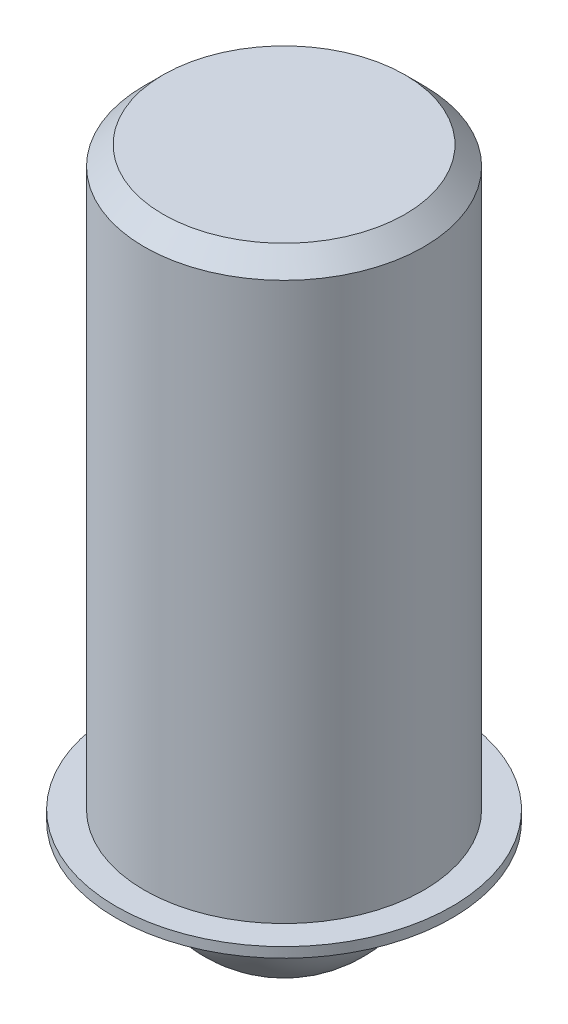
ISO-10303-21;
HEADER;
FILE_DESCRIPTION(('STEP AP214'),'2;1');
FILE_NAME('part.step','',(''),(''),'','','');
FILE_SCHEMA(('AUTOMOTIVE_DESIGN { 1 0 10303 214 1 1 1 1 }'));
ENDSEC;
DATA;
#1=APPLICATION_CONTEXT('core data for automotive mechanical design processes');
#2=APPLICATION_PROTOCOL_DEFINITION('international standard','automotive_design',2000,#1);
#3=PRODUCT_CONTEXT('',#1,'mechanical');
#4=PRODUCT('Part','Part','',(#3));
#5=PRODUCT_RELATED_PRODUCT_CATEGORY('part','',(#4));
#6=PRODUCT_DEFINITION_FORMATION('','',#4);
#7=PRODUCT_DEFINITION_CONTEXT('part definition',#1,'design');
#8=PRODUCT_DEFINITION('design','',#6,#7);
#9=PRODUCT_DEFINITION_SHAPE('','',#8);
#10=(LENGTH_UNIT() NAMED_UNIT(*) SI_UNIT(.MILLI.,.METRE.));
#11=(NAMED_UNIT(*) PLANE_ANGLE_UNIT() SI_UNIT($,.RADIAN.));
#12=(NAMED_UNIT(*) SI_UNIT($,.STERADIAN.) SOLID_ANGLE_UNIT());
#13=UNCERTAINTY_MEASURE_WITH_UNIT(LENGTH_MEASURE(1.E-05),#10,'distance_accuracy_value','');
#14=(GEOMETRIC_REPRESENTATION_CONTEXT(3) GLOBAL_UNCERTAINTY_ASSIGNED_CONTEXT((#13)) GLOBAL_UNIT_ASSIGNED_CONTEXT((#10,
#11,#12)) REPRESENTATION_CONTEXT('',''));
#15=CARTESIAN_POINT('',(0.,0.,0.));
#16=DIRECTION('',(0.,0.,1.));
#17=DIRECTION('',(1.,0.,0.));
#18=AXIS2_PLACEMENT_3D('',#15,#16,#17);
#19=CARTESIAN_POINT('',(0.,-6.4516,3.175));
#20=DIRECTION('',(0.,-1.,0.));
#21=DIRECTION('',(0.,0.,-1.));
#22=AXIS2_PLACEMENT_3D('',#19,#20,#21);
#23=PLANE('',#22);
#24=CARTESIAN_POINT('',(0.,-6.4516,0.));
#25=DIRECTION('',(0.,1.,0.));
#26=DIRECTION('',(0.,0.,1.));
#27=AXIS2_PLACEMENT_3D('',#24,#25,#26);
#28=CIRCLE('',#27,3.175);
#29=CARTESIAN_POINT('',(0.,-6.4516,3.175));
#30=VERTEX_POINT('',#29);
#31=EDGE_CURVE('P0_E17',#30,#30,#28,.F.);
#32=ORIENTED_EDGE('',*,*,#31,.T.);
#33=EDGE_LOOP('',(#32));
#34=FACE_BOUND('',#33,.T.);
#35=ADVANCED_FACE('P0_F14',(#34),#23,.T.);
#36=CARTESIAN_POINT('',(0.,9.8806,0.));
#37=DIRECTION('',(0.,1.,0.));
#38=DIRECTION('',(0.,0.,1.));
#39=AXIS2_PLACEMENT_3D('',#36,#37,#38);
#40=CYLINDRICAL_SURFACE('',#39,3.175);
#41=ORIENTED_EDGE('',*,*,#31,.F.);
#42=EDGE_LOOP('',(#41));
#43=FACE_BOUND('',#42,.T.);
#44=CARTESIAN_POINT('',(0.,-7.5946,0.));
#45=DIRECTION('',(0.,1.,0.));
#46=DIRECTION('',(0.,0.,1.));
#47=AXIS2_PLACEMENT_3D('',#44,#45,#46);
#48=CIRCLE('',#47,3.175);
#49=CARTESIAN_POINT('',(0.,-7.5946,3.175));
#50=VERTEX_POINT('',#49);
#51=EDGE_CURVE('P0_E40',#50,#50,#48,.T.);
#52=ORIENTED_EDGE('',*,*,#51,.F.);
#53=EDGE_LOOP('',(#52));
#54=FACE_BOUND('',#53,.T.);
#55=ADVANCED_FACE('P0_F48',(#43,#54),#40,.F.);
#56=CARTESIAN_POINT('',(0.,-7.5946,3.429));
#57=DIRECTION('',(0.,-1.,0.));
#58=DIRECTION('',(0.,0.,-1.));
#59=AXIS2_PLACEMENT_3D('',#56,#57,#58);
#60=PLANE('',#59);
#61=ORIENTED_EDGE('',*,*,#51,.T.);
#62=EDGE_LOOP('',(#61));
#63=FACE_BOUND('',#62,.T.);
#64=CARTESIAN_POINT('',(0.,-7.5945999999476,0.));
#65=DIRECTION('',(0.,1.,0.));
#66=DIRECTION('',(0.,0.,1.));
#67=AXIS2_PLACEMENT_3D('',#64,#65,#66);
#68=CIRCLE('',#67,3.42900000003965);
#69=CARTESIAN_POINT('',(0.,-7.5945999999476,3.42900000003965));
#70=VERTEX_POINT('',#69);
#71=EDGE_CURVE('P0_E38',#70,#70,#68,.T.);
#72=ORIENTED_EDGE('',*,*,#71,.F.);
#73=EDGE_LOOP('',(#72));
#74=FACE_BOUND('',#73,.T.);
#75=ADVANCED_FACE('P0_F51',(#63,#74),#60,.T.);
#76=CARTESIAN_POINT('',(0.,-6.73735000003717,0.));
#77=DIRECTION('',(0.,1.,0.));
#78=DIRECTION('',(0.,0.,1.));
#79=AXIS2_PLACEMENT_3D('',#76,#77,#78);
#80=CONICAL_SURFACE('',#79,4.76249999991296,0.999458846965579);
#81=ORIENTED_EDGE('',*,*,#71,.T.);
#82=EDGE_LOOP('',(#81));
#83=FACE_BOUND('',#82,.T.);
#84=CARTESIAN_POINT('',(0.,-6.73735,0.));
#85=DIRECTION('',(0.,1.,0.));
#86=DIRECTION('',(0.,0.,1.));
#87=AXIS2_PLACEMENT_3D('',#84,#85,#86);
#88=CIRCLE('',#87,4.7625);
#89=CARTESIAN_POINT('',(0.,-6.73735,4.7625));
#90=VERTEX_POINT('',#89);
#91=EDGE_CURVE('P0_E37',#90,#90,#88,.T.);
#92=ORIENTED_EDGE('',*,*,#91,.F.);
#93=EDGE_LOOP('',(#92));
#94=FACE_BOUND('',#93,.T.);
#95=ADVANCED_FACE('P0_F57',(#83,#94),#80,.T.);
#96=CARTESIAN_POINT('',(0.,9.8806,3.429));
#97=DIRECTION('',(0.,1.,0.));
#98=DIRECTION('',(0.,0.,1.));
#99=AXIS2_PLACEMENT_3D('',#96,#97,#98);
#100=PLANE('',#99);
#101=CARTESIAN_POINT('',(0.,9.88060000003088,0.));
#102=DIRECTION('',(0.,-1.,0.));
#103=DIRECTION('',(0.,0.,-1.));
#104=AXIS2_PLACEMENT_3D('',#101,#102,#103);
#105=CIRCLE('',#104,3.42899999998281);
#106=CARTESIAN_POINT('',(0.,9.88060000003088,-3.42899999998281));
#107=VERTEX_POINT('',#106);
#108=EDGE_CURVE('P0_E34',#107,#107,#105,.T.);
#109=ORIENTED_EDGE('',*,*,#108,.F.);
#110=EDGE_LOOP('',(#109));
#111=FACE_BOUND('',#110,.T.);
#112=ADVANCED_FACE('P0_F77',(#111),#100,.T.);
#113=CARTESIAN_POINT('',(0.,9.8806,0.));
#114=DIRECTION('',(0.,1.,0.));
#115=DIRECTION('',(0.,0.,1.));
#116=AXIS2_PLACEMENT_3D('',#113,#114,#115);
#117=CYLINDRICAL_SURFACE('',#116,4.7625);
#118=ORIENTED_EDGE('',*,*,#91,.T.);
#119=EDGE_LOOP('',(#118));
#120=FACE_BOUND('',#119,.T.);
#121=CARTESIAN_POINT('',(0.,-6.4516,0.));
#122=DIRECTION('',(0.,1.,0.));
#123=DIRECTION('',(0.,0.,1.));
#124=AXIS2_PLACEMENT_3D('',#121,#122,#123);
#125=CIRCLE('',#124,4.7625);
#126=CARTESIAN_POINT('',(0.,-6.4516,4.7625));
#127=VERTEX_POINT('',#126);
#128=EDGE_CURVE('P0_E26',#127,#127,#125,.T.);
#129=ORIENTED_EDGE('',*,*,#128,.F.);
#130=EDGE_LOOP('',(#129));
#131=FACE_BOUND('',#130,.T.);
#132=ADVANCED_FACE('P0_F73',(#120,#131),#117,.T.);
#133=CARTESIAN_POINT('',(0.,9.34719999986555,0.));
#134=DIRECTION('',(0.,-1.,0.));
#135=DIRECTION('',(0.,0.,-1.));
#136=AXIS2_PLACEMENT_3D('',#133,#134,#135);
#137=CONICAL_SURFACE('',#136,3.96240000009129,0.785398163344164);
#138=ORIENTED_EDGE('',*,*,#108,.T.);
#139=EDGE_LOOP('',(#138));
#140=FACE_BOUND('',#139,.T.);
#141=CARTESIAN_POINT('',(0.,9.3472,0.));
#142=DIRECTION('',(0.,1.,0.));
#143=DIRECTION('',(0.,0.,1.));
#144=AXIS2_PLACEMENT_3D('',#141,#142,#143);
#145=CIRCLE('',#144,3.9624);
#146=CARTESIAN_POINT('',(0.,9.3472,3.9624));
#147=VERTEX_POINT('',#146);
#148=EDGE_CURVE('P0_E21',#147,#147,#145,.F.);
#149=ORIENTED_EDGE('',*,*,#148,.F.);
#150=EDGE_LOOP('',(#149));
#151=FACE_BOUND('',#150,.T.);
#152=ADVANCED_FACE('P0_F66',(#140,#151),#137,.T.);
#153=CARTESIAN_POINT('',(0.,-6.4516,4.7625));
#154=DIRECTION('',(0.,1.,0.));
#155=DIRECTION('',(0.,0.,1.));
#156=AXIS2_PLACEMENT_3D('',#153,#154,#155);
#157=PLANE('',#156);
#158=CARTESIAN_POINT('',(0.,-6.4516,0.));
#159=DIRECTION('',(0.,1.,0.));
#160=DIRECTION('',(0.,0.,1.));
#161=AXIS2_PLACEMENT_3D('',#158,#159,#160);
#162=CIRCLE('',#161,3.9624);
#163=CARTESIAN_POINT('',(0.,-6.4516,3.9624));
#164=VERTEX_POINT('',#163);
#165=EDGE_CURVE('P0_E10',#164,#164,#162,.T.);
#166=ORIENTED_EDGE('',*,*,#165,.F.);
#167=EDGE_LOOP('',(#166));
#168=FACE_BOUND('',#167,.T.);
#169=ORIENTED_EDGE('',*,*,#128,.T.);
#170=EDGE_LOOP('',(#169));
#171=FACE_BOUND('',#170,.T.);
#172=ADVANCED_FACE('P0_F61',(#168,#171),#157,.T.);
#173=CARTESIAN_POINT('',(0.,9.8806,0.));
#174=DIRECTION('',(0.,1.,0.));
#175=DIRECTION('',(0.,0.,1.));
#176=AXIS2_PLACEMENT_3D('',#173,#174,#175);
#177=CYLINDRICAL_SURFACE('',#176,3.9624);
#178=ORIENTED_EDGE('',*,*,#165,.T.);
#179=EDGE_LOOP('',(#178));
#180=FACE_BOUND('',#179,.T.);
#181=ORIENTED_EDGE('',*,*,#148,.T.);
#182=EDGE_LOOP('',(#181));
#183=FACE_BOUND('',#182,.T.);
#184=ADVANCED_FACE('P0_F59',(#180,#183),#177,.T.);
#185=CLOSED_SHELL('',(#35,#55,#75,#95,#112,#132,#152,#172,#184));
#186=MANIFOLD_SOLID_BREP('P0_B1',#185);
#187=CARTESIAN_POINT('',(0.,-6.7056,0.));
#188=DIRECTION('',(0.,0.,1.));
#189=DIRECTION('',(0.,1.,0.));
#190=AXIS2_PLACEMENT_3D('',#187,#188,#189);
#191=SPHERICAL_SURFACE('',#190,3.175);
#192=CARTESIAN_POINT('',(0.,-6.7056,-3.175));
#193=VERTEX_POINT('',#192);
#194=VERTEX_LOOP('',#193);
#195=FACE_BOUND('',#194,.T.);
#196=CARTESIAN_POINT('',(0.,-6.7056,3.175));
#197=VERTEX_POINT('',#196);
#198=VERTEX_LOOP('',#197);
#199=FACE_BOUND('',#198,.T.);
#200=ADVANCED_FACE('P1_F15',(#195,#199),#191,.T.);
#201=CLOSED_SHELL('',(#200));
#202=MANIFOLD_SOLID_BREP('P1_B1',#201);
#203=ADVANCED_BREP_SHAPE_REPRESENTATION('',(#18,#186,#202),#14);
#204=SHAPE_DEFINITION_REPRESENTATION(#9,#203);
ENDSEC;
END-ISO-10303-21;
